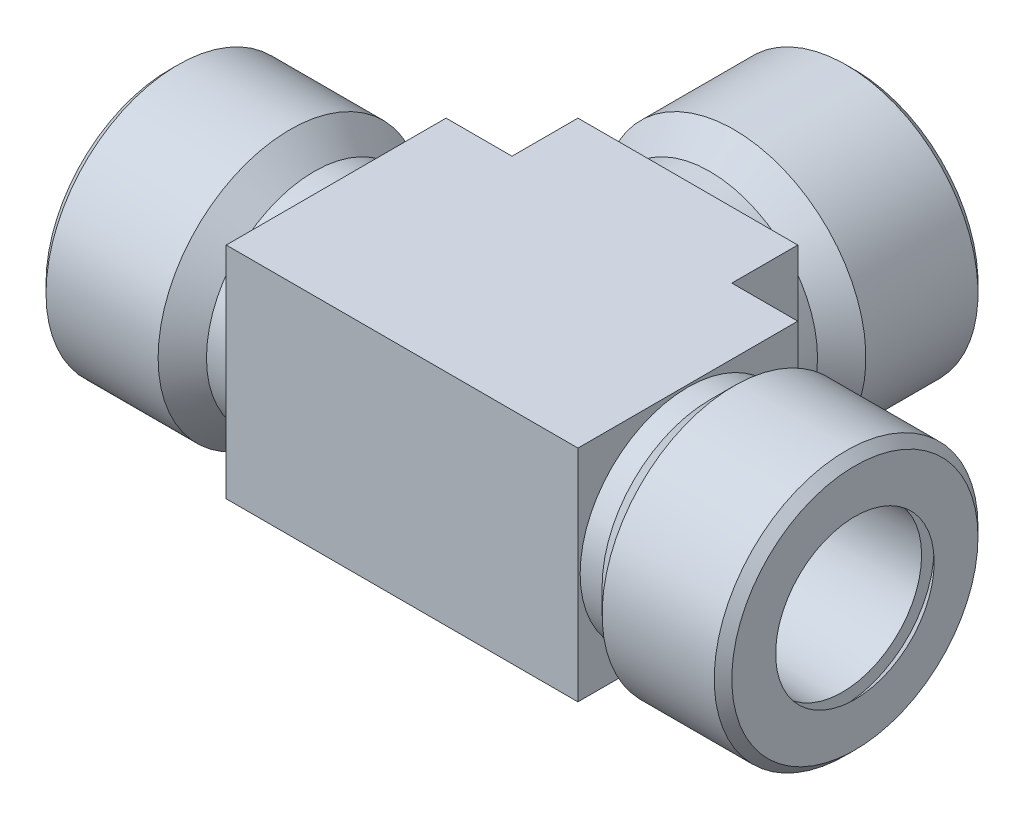
ISO-10303-21;
HEADER;
FILE_DESCRIPTION(('STEP AP214'),'2;1');
FILE_NAME('part.step','',(''),(''),'','','');
FILE_SCHEMA(('AUTOMOTIVE_DESIGN { 1 0 10303 214 1 1 1 1 }'));
ENDSEC;
DATA;
#1=APPLICATION_CONTEXT('core data for automotive mechanical design processes');
#2=APPLICATION_PROTOCOL_DEFINITION('international standard','automotive_design',2000,#1);
#3=PRODUCT_CONTEXT('',#1,'mechanical');
#4=PRODUCT('Part','Part','',(#3));
#5=PRODUCT_RELATED_PRODUCT_CATEGORY('part','',(#4));
#6=PRODUCT_DEFINITION_FORMATION('','',#4);
#7=PRODUCT_DEFINITION_CONTEXT('part definition',#1,'design');
#8=PRODUCT_DEFINITION('design','',#6,#7);
#9=PRODUCT_DEFINITION_SHAPE('','',#8);
#10=(LENGTH_UNIT() NAMED_UNIT(*) SI_UNIT(.MILLI.,.METRE.));
#11=(NAMED_UNIT(*) PLANE_ANGLE_UNIT() SI_UNIT($,.RADIAN.));
#12=(NAMED_UNIT(*) SI_UNIT($,.STERADIAN.) SOLID_ANGLE_UNIT());
#13=UNCERTAINTY_MEASURE_WITH_UNIT(LENGTH_MEASURE(1.E-05),#10,'distance_accuracy_value','');
#14=(GEOMETRIC_REPRESENTATION_CONTEXT(3) GLOBAL_UNCERTAINTY_ASSIGNED_CONTEXT((#13)) GLOBAL_UNIT_ASSIGNED_CONTEXT((#10,
#11,#12)) REPRESENTATION_CONTEXT('',''));
#15=CARTESIAN_POINT('',(0.,0.,0.));
#16=DIRECTION('',(0.,0.,1.));
#17=DIRECTION('',(1.,0.,0.));
#18=AXIS2_PLACEMENT_3D('',#15,#16,#17);
#19=CARTESIAN_POINT('',(65.67678,0.,0.));
#20=DIRECTION('',(-1.,0.,0.));
#21=DIRECTION('',(0.,0.,1.));
#22=AXIS2_PLACEMENT_3D('',#19,#20,#21);
#23=CYLINDRICAL_SURFACE('',#22,9.271);
#24=CARTESIAN_POINT('',(39.624,0.,0.));
#25=DIRECTION('',(0.707106781186548,0.,-0.707106781186547));
#26=DIRECTION('',(-0.707106781186547,0.,-0.707106781186548));
#27=AXIS2_PLACEMENT_3D('',#24,#25,#26);
#28=ELLIPSE('',#27,13.111173936761,9.271);
#29=CARTESIAN_POINT('',(39.624,9.271,0.));
#30=VERTEX_POINT('',#29);
#31=CARTESIAN_POINT('',(39.624,-9.271,0.));
#32=VERTEX_POINT('',#31);
#33=EDGE_CURVE('E102',#30,#32,#28,.F.);
#34=ORIENTED_EDGE('',*,*,#33,.F.);
#35=CARTESIAN_POINT('',(39.624,0.,0.));
#36=DIRECTION('',(-0.707106781186547,0.,-0.707106781186548));
#37=DIRECTION('',(0.707106781186548,0.,-0.707106781186547));
#38=AXIS2_PLACEMENT_3D('',#35,#36,#37);
#39=ELLIPSE('',#38,13.111173936761,9.271);
#40=EDGE_CURVE('E48',#32,#30,#39,.F.);
#41=ORIENTED_EDGE('',*,*,#40,.F.);
#42=EDGE_LOOP('',(#34,#41));
#43=FACE_BOUND('',#42,.T.);
#44=CARTESIAN_POINT('',(65.67678,0.,0.));
#45=DIRECTION('',(-1.,0.,0.));
#46=DIRECTION('',(0.,0.,-1.));
#47=AXIS2_PLACEMENT_3D('',#44,#45,#46);
#48=CIRCLE('',#47,9.271);
#49=CARTESIAN_POINT('',(65.67678,0.,-9.271));
#50=VERTEX_POINT('',#49);
#51=EDGE_CURVE('E111',#50,#50,#48,.T.);
#52=ORIENTED_EDGE('',*,*,#51,.F.);
#53=EDGE_LOOP('',(#52));
#54=FACE_BOUND('',#53,.T.);
#55=CARTESIAN_POINT('',(13.57122,0.,0.));
#56=DIRECTION('',(-1.,0.,0.));
#57=DIRECTION('',(0.,0.,-1.));
#58=AXIS2_PLACEMENT_3D('',#55,#56,#57);
#59=CIRCLE('',#58,9.271);
#60=CARTESIAN_POINT('',(13.57122,0.,-9.271));
#61=VERTEX_POINT('',#60);
#62=EDGE_CURVE('E108',#61,#61,#59,.T.);
#63=ORIENTED_EDGE('',*,*,#62,.T.);
#64=EDGE_LOOP('',(#63));
#65=FACE_BOUND('',#64,.T.);
#66=ADVANCED_FACE('F34',(#43,#54,#65),#23,.F.);
#67=CARTESIAN_POINT('',(65.67678,0.,0.));
#68=DIRECTION('',(1.,0.,0.));
#69=DIRECTION('',(0.,0.,-1.));
#70=AXIS2_PLACEMENT_3D('',#67,#68,#69);
#71=PLANE('',#70);
#72=CARTESIAN_POINT('',(65.67678,0.,0.));
#73=DIRECTION('',(-1.,0.,0.));
#74=DIRECTION('',(0.,0.,-1.));
#75=AXIS2_PLACEMENT_3D('',#72,#73,#74);
#76=CIRCLE('',#75,8.84936340276163);
#77=CARTESIAN_POINT('',(65.67678,0.,-8.84936340276163));
#78=VERTEX_POINT('',#77);
#79=EDGE_CURVE('E411',#78,#78,#76,.T.);
#80=ORIENTED_EDGE('',*,*,#79,.F.);
#81=EDGE_LOOP('',(#80));
#82=FACE_BOUND('',#81,.T.);
#83=ORIENTED_EDGE('',*,*,#51,.T.);
#84=EDGE_LOOP('',(#83));
#85=FACE_BOUND('',#84,.T.);
#86=ADVANCED_FACE('F232',(#82,#85),#71,.F.);
#87=CARTESIAN_POINT('',(13.57122,0.,0.));
#88=DIRECTION('',(1.,0.,0.));
#89=DIRECTION('',(0.,0.,-1.));
#90=AXIS2_PLACEMENT_3D('',#87,#88,#89);
#91=PLANE('',#90);
#92=CARTESIAN_POINT('',(13.57122,0.,0.));
#93=DIRECTION('',(1.,0.,0.));
#94=DIRECTION('',(0.,0.,1.));
#95=AXIS2_PLACEMENT_3D('',#92,#93,#94);
#96=CIRCLE('',#95,8.84936340276163);
#97=CARTESIAN_POINT('',(13.57122,0.,8.84936340276163));
#98=VERTEX_POINT('',#97);
#99=EDGE_CURVE('E353',#98,#98,#96,.T.);
#100=ORIENTED_EDGE('',*,*,#99,.F.);
#101=EDGE_LOOP('',(#100));
#102=FACE_BOUND('',#101,.T.);
#103=ORIENTED_EDGE('',*,*,#62,.F.);
#104=EDGE_LOOP('',(#103));
#105=FACE_BOUND('',#104,.T.);
#106=ADVANCED_FACE('F237',(#102,#105),#91,.T.);
#107=CARTESIAN_POINT('',(39.624,0.,-26.05278));
#108=DIRECTION('',(0.,0.,1.));
#109=DIRECTION('',(1.,0.,0.));
#110=AXIS2_PLACEMENT_3D('',#107,#108,#109);
#111=PLANE('',#110);
#112=CARTESIAN_POINT('',(39.624,0.,-26.05278));
#113=DIRECTION('',(0.,0.,1.));
#114=DIRECTION('',(-1.,0.,0.));
#115=AXIS2_PLACEMENT_3D('',#112,#113,#114);
#116=CIRCLE('',#115,8.84936340276166);
#117=CARTESIAN_POINT('',(30.7746365972383,0.,-26.05278));
#118=VERTEX_POINT('',#117);
#119=EDGE_CURVE('E346',#118,#118,#116,.T.);
#120=ORIENTED_EDGE('',*,*,#119,.F.);
#121=EDGE_LOOP('',(#120));
#122=FACE_BOUND('',#121,.T.);
#123=CARTESIAN_POINT('',(39.624,0.,-26.05278));
#124=DIRECTION('',(0.,0.,-1.));
#125=DIRECTION('',(1.,0.,0.));
#126=AXIS2_PLACEMENT_3D('',#123,#124,#125);
#127=CIRCLE('',#126,9.271);
#128=CARTESIAN_POINT('',(48.895,0.,-26.05278));
#129=VERTEX_POINT('',#128);
#130=EDGE_CURVE('E105',#129,#129,#127,.T.);
#131=ORIENTED_EDGE('',*,*,#130,.F.);
#132=EDGE_LOOP('',(#131));
#133=FACE_BOUND('',#132,.T.);
#134=ADVANCED_FACE('F365',(#122,#133),#111,.T.);
#135=CARTESIAN_POINT('',(39.624,0.,15.241));
#136=DIRECTION('',(0.,0.,-1.));
#137=DIRECTION('',(-1.,0.,0.));
#138=AXIS2_PLACEMENT_3D('',#135,#136,#137);
#139=CYLINDRICAL_SURFACE('',#138,9.271);
#140=ORIENTED_EDGE('',*,*,#130,.T.);
#141=EDGE_LOOP('',(#140));
#142=FACE_BOUND('',#141,.T.);
#143=ORIENTED_EDGE('',*,*,#40,.T.);
#144=ORIENTED_EDGE('',*,*,#33,.T.);
#145=EDGE_LOOP('',(#143,#144));
#146=FACE_BOUND('',#145,.T.);
#147=ADVANCED_FACE('F103',(#142,#146),#139,.F.);
#148=CARTESIAN_POINT('',(39.624,0.,-26.05278));
#149=DIRECTION('',(0.,0.,-1.));
#150=DIRECTION('',(-1.,0.,0.));
#151=AXIS2_PLACEMENT_3D('',#148,#149,#150);
#152=CONICAL_SURFACE('',#151,8.84936340276166,0.0256563400043202);
#153=CARTESIAN_POINT('',(39.624,0.,-38.172644));
#154=DIRECTION('',(0.,0.,-1.));
#155=DIRECTION('',(-1.,0.,0.));
#156=AXIS2_PLACEMENT_3D('',#153,#154,#155);
#157=CIRCLE('',#156,9.16038300000006);
#158=CARTESIAN_POINT('',(30.4636169999999,0.,-38.172644));
#159=VERTEX_POINT('',#158);
#160=EDGE_CURVE('E350',#159,#159,#157,.F.);
#161=ORIENTED_EDGE('',*,*,#160,.F.);
#162=EDGE_LOOP('',(#161));
#163=FACE_BOUND('',#162,.T.);
#164=ORIENTED_EDGE('',*,*,#119,.T.);
#165=EDGE_LOOP('',(#164));
#166=FACE_BOUND('',#165,.T.);
#167=ADVANCED_FACE('F321',(#163,#166),#152,.F.);
#168=CARTESIAN_POINT('',(59.944,-12.7,-20.32));
#169=DIRECTION('',(0.,0.,-1.));
#170=DIRECTION('',(-1.,0.,0.));
#171=AXIS2_PLACEMENT_3D('',#168,#169,#170);
#172=PLANE('',#171);
#173=DIRECTION('',(0.,-1.,0.));
#174=VECTOR('',#173,1.);
#175=CARTESIAN_POINT('',(26.924,12.7,-20.32));
#176=LINE('',#175,#174);
#177=CARTESIAN_POINT('',(26.924,12.7,-20.32));
#178=VERTEX_POINT('',#177);
#179=CARTESIAN_POINT('',(26.924,-12.7,-20.32));
#180=VERTEX_POINT('',#179);
#181=EDGE_CURVE('E150',#178,#180,#176,.T.);
#182=ORIENTED_EDGE('',*,*,#181,.F.);
#183=DIRECTION('',(-1.,0.,0.));
#184=VECTOR('',#183,1.);
#185=CARTESIAN_POINT('',(59.944,12.7,-20.32));
#186=LINE('',#185,#184);
#187=CARTESIAN_POINT('',(52.324,12.7,-20.32));
#188=VERTEX_POINT('',#187);
#189=EDGE_CURVE('E197',#188,#178,#186,.T.);
#190=ORIENTED_EDGE('',*,*,#189,.F.);
#191=DIRECTION('',(0.,-1.,0.));
#192=VECTOR('',#191,1.);
#193=CARTESIAN_POINT('',(52.324,12.7,-20.32));
#194=LINE('',#193,#192);
#195=CARTESIAN_POINT('',(52.324,-12.7,-20.32));
#196=VERTEX_POINT('',#195);
#197=EDGE_CURVE('E175',#188,#196,#194,.T.);
#198=ORIENTED_EDGE('',*,*,#197,.T.);
#199=DIRECTION('',(-1.,0.,0.));
#200=VECTOR('',#199,1.);
#201=CARTESIAN_POINT('',(59.944,-12.7,-20.32));
#202=LINE('',#201,#200);
#203=EDGE_CURVE('E186',#196,#180,#202,.T.);
#204=ORIENTED_EDGE('',*,*,#203,.T.);
#205=EDGE_LOOP('',(#182,#190,#198,#204));
#206=FACE_BOUND('',#205,.T.);
#207=CARTESIAN_POINT('',(39.624,0.,-20.32));
#208=DIRECTION('',(0.,0.,-1.));
#209=DIRECTION('',(-1.,0.,0.));
#210=AXIS2_PLACEMENT_3D('',#207,#208,#209);
#211=CIRCLE('',#210,12.446);
#212=CARTESIAN_POINT('',(27.178,0.,-20.32));
#213=VERTEX_POINT('',#212);
#214=EDGE_CURVE('E120',#213,#213,#211,.T.);
#215=ORIENTED_EDGE('',*,*,#214,.F.);
#216=EDGE_LOOP('',(#215));
#217=FACE_BOUND('',#216,.T.);
#218=ADVANCED_FACE('F318',(#206,#217),#172,.T.);
#219=CARTESIAN_POINT('',(59.944,-12.7,12.7));
#220=DIRECTION('',(1.,0.,0.));
#221=DIRECTION('',(0.,0.,-1.));
#222=AXIS2_PLACEMENT_3D('',#219,#220,#221);
#223=PLANE('',#222);
#224=DIRECTION('',(0.,-1.,0.));
#225=VECTOR('',#224,1.);
#226=CARTESIAN_POINT('',(59.944,12.7,-12.7));
#227=LINE('',#226,#225);
#228=CARTESIAN_POINT('',(59.944,12.7,-12.7));
#229=VERTEX_POINT('',#228);
#230=CARTESIAN_POINT('',(59.944,-12.7,-12.7));
#231=VERTEX_POINT('',#230);
#232=EDGE_CURVE('E172',#229,#231,#227,.T.);
#233=ORIENTED_EDGE('',*,*,#232,.F.);
#234=DIRECTION('',(0.,0.,-1.));
#235=VECTOR('',#234,1.);
#236=CARTESIAN_POINT('',(59.944,12.7,12.7));
#237=LINE('',#236,#235);
#238=CARTESIAN_POINT('',(59.944,12.7,12.7));
#239=VERTEX_POINT('',#238);
#240=EDGE_CURVE('E194',#239,#229,#237,.T.);
#241=ORIENTED_EDGE('',*,*,#240,.F.);
#242=DIRECTION('',(0.,1.,0.));
#243=VECTOR('',#242,1.);
#244=CARTESIAN_POINT('',(59.944,-12.7,12.7));
#245=LINE('',#244,#243);
#246=CARTESIAN_POINT('',(59.944,-12.7,12.7));
#247=VERTEX_POINT('',#246);
#248=EDGE_CURVE('E191',#247,#239,#245,.T.);
#249=ORIENTED_EDGE('',*,*,#248,.F.);
#250=DIRECTION('',(0.,0.,-1.));
#251=VECTOR('',#250,1.);
#252=CARTESIAN_POINT('',(59.944,-12.7,12.7));
#253=LINE('',#252,#251);
#254=EDGE_CURVE('E182',#247,#231,#253,.T.);
#255=ORIENTED_EDGE('',*,*,#254,.T.);
#256=EDGE_LOOP('',(#233,#241,#249,#255));
#257=FACE_BOUND('',#256,.T.);
#258=CARTESIAN_POINT('',(59.944,0.,0.));
#259=DIRECTION('',(1.,0.,0.));
#260=DIRECTION('',(0.,0.,-1.));
#261=AXIS2_PLACEMENT_3D('',#258,#259,#260);
#262=CIRCLE('',#261,12.446);
#263=CARTESIAN_POINT('',(59.944,0.,-12.446));
#264=VERTEX_POINT('',#263);
#265=EDGE_CURVE('E129',#264,#264,#262,.T.);
#266=ORIENTED_EDGE('',*,*,#265,.F.);
#267=EDGE_LOOP('',(#266));
#268=FACE_BOUND('',#267,.T.);
#269=ADVANCED_FACE('F316',(#257,#268),#223,.T.);
#270=CARTESIAN_POINT('',(19.304,-12.7,-20.32));
#271=DIRECTION('',(-1.,0.,0.));
#272=DIRECTION('',(0.,0.,1.));
#273=AXIS2_PLACEMENT_3D('',#270,#271,#272);
#274=PLANE('',#273);
#275=DIRECTION('',(0.,-1.,0.));
#276=VECTOR('',#275,1.);
#277=CARTESIAN_POINT('',(19.304,12.7,-12.7));
#278=LINE('',#277,#276);
#279=CARTESIAN_POINT('',(19.304,12.7,-12.7));
#280=VERTEX_POINT('',#279);
#281=CARTESIAN_POINT('',(19.304,-12.7,-12.7));
#282=VERTEX_POINT('',#281);
#283=EDGE_CURVE('E154',#280,#282,#278,.T.);
#284=ORIENTED_EDGE('',*,*,#283,.T.);
#285=DIRECTION('',(0.,0.,1.));
#286=VECTOR('',#285,1.);
#287=CARTESIAN_POINT('',(19.304,-12.7,-20.32));
#288=LINE('',#287,#286);
#289=CARTESIAN_POINT('',(19.304,-12.7,12.7));
#290=VERTEX_POINT('',#289);
#291=EDGE_CURVE('E189',#282,#290,#288,.T.);
#292=ORIENTED_EDGE('',*,*,#291,.T.);
#293=DIRECTION('',(0.,1.,0.));
#294=VECTOR('',#293,1.);
#295=CARTESIAN_POINT('',(19.304,-12.7,12.7));
#296=LINE('',#295,#294);
#297=CARTESIAN_POINT('',(19.304,12.7,12.7));
#298=VERTEX_POINT('',#297);
#299=EDGE_CURVE('E201',#290,#298,#296,.T.);
#300=ORIENTED_EDGE('',*,*,#299,.T.);
#301=DIRECTION('',(0.,0.,1.));
#302=VECTOR('',#301,1.);
#303=CARTESIAN_POINT('',(19.304,12.7,-20.32));
#304=LINE('',#303,#302);
#305=EDGE_CURVE('E183',#280,#298,#304,.T.);
#306=ORIENTED_EDGE('',*,*,#305,.F.);
#307=EDGE_LOOP('',(#284,#292,#300,#306));
#308=FACE_BOUND('',#307,.T.);
#309=CARTESIAN_POINT('',(19.304,0.,0.));
#310=DIRECTION('',(-1.,0.,0.));
#311=DIRECTION('',(0.,0.,1.));
#312=AXIS2_PLACEMENT_3D('',#309,#310,#311);
#313=CIRCLE('',#312,12.446);
#314=CARTESIAN_POINT('',(19.304,0.,12.446));
#315=VERTEX_POINT('',#314);
#316=EDGE_CURVE('E138',#315,#315,#313,.T.);
#317=ORIENTED_EDGE('',*,*,#316,.F.);
#318=EDGE_LOOP('',(#317));
#319=FACE_BOUND('',#318,.T.);
#320=ADVANCED_FACE('F313',(#308,#319),#274,.T.);
#321=CARTESIAN_POINT('',(19.304,-12.7,12.7));
#322=DIRECTION('',(0.,0.,1.));
#323=DIRECTION('',(1.,0.,0.));
#324=AXIS2_PLACEMENT_3D('',#321,#322,#323);
#325=PLANE('',#324);
#326=DIRECTION('',(1.,0.,0.));
#327=VECTOR('',#326,1.);
#328=CARTESIAN_POINT('',(19.304,12.7,12.7));
#329=LINE('',#328,#327);
#330=EDGE_CURVE('E174',#298,#239,#329,.T.);
#331=ORIENTED_EDGE('',*,*,#330,.F.);
#332=ORIENTED_EDGE('',*,*,#299,.F.);
#333=DIRECTION('',(1.,0.,0.));
#334=VECTOR('',#333,1.);
#335=CARTESIAN_POINT('',(19.304,-12.7,12.7));
#336=LINE('',#335,#334);
#337=EDGE_CURVE('E179',#290,#247,#336,.T.);
#338=ORIENTED_EDGE('',*,*,#337,.T.);
#339=ORIENTED_EDGE('',*,*,#248,.T.);
#340=EDGE_LOOP('',(#331,#332,#338,#339));
#341=FACE_BOUND('',#340,.T.);
#342=ADVANCED_FACE('F308',(#341),#325,.T.);
#343=CARTESIAN_POINT('',(59.944,-12.7,12.7));
#344=DIRECTION('',(0.,1.,0.));
#345=DIRECTION('',(0.,0.,1.));
#346=AXIS2_PLACEMENT_3D('',#343,#344,#345);
#347=PLANE('',#346);
#348=ORIENTED_EDGE('',*,*,#291,.F.);
#349=DIRECTION('',(-1.,0.,0.));
#350=VECTOR('',#349,1.);
#351=CARTESIAN_POINT('',(26.924,-12.7,-12.7));
#352=LINE('',#351,#350);
#353=CARTESIAN_POINT('',(26.924,-12.7,-12.7));
#354=VERTEX_POINT('',#353);
#355=EDGE_CURVE('E148',#354,#282,#352,.T.);
#356=ORIENTED_EDGE('',*,*,#355,.F.);
#357=DIRECTION('',(0.,0.,1.));
#358=VECTOR('',#357,1.);
#359=CARTESIAN_POINT('',(26.924,-12.7,-20.32));
#360=LINE('',#359,#358);
#361=EDGE_CURVE('E142',#180,#354,#360,.T.);
#362=ORIENTED_EDGE('',*,*,#361,.F.);
#363=ORIENTED_EDGE('',*,*,#203,.F.);
#364=DIRECTION('',(0.,0.,-1.));
#365=VECTOR('',#364,1.);
#366=CARTESIAN_POINT('',(52.324,-12.7,-12.7));
#367=LINE('',#366,#365);
#368=CARTESIAN_POINT('',(52.324,-12.7,-12.7));
#369=VERTEX_POINT('',#368);
#370=EDGE_CURVE('E165',#369,#196,#367,.T.);
#371=ORIENTED_EDGE('',*,*,#370,.F.);
#372=DIRECTION('',(-1.,0.,0.));
#373=VECTOR('',#372,1.);
#374=CARTESIAN_POINT('',(59.944,-12.7,-12.7));
#375=LINE('',#374,#373);
#376=EDGE_CURVE('E157',#231,#369,#375,.T.);
#377=ORIENTED_EDGE('',*,*,#376,.F.);
#378=ORIENTED_EDGE('',*,*,#254,.F.);
#379=ORIENTED_EDGE('',*,*,#337,.F.);
#380=EDGE_LOOP('',(#348,#356,#362,#363,#371,#377,#378,#379));
#381=FACE_BOUND('',#380,.T.);
#382=ADVANCED_FACE('F305',(#381),#347,.F.);
#383=CARTESIAN_POINT('',(59.944,12.7,12.7));
#384=DIRECTION('',(0.,1.,0.));
#385=DIRECTION('',(0.,0.,1.));
#386=AXIS2_PLACEMENT_3D('',#383,#384,#385);
#387=PLANE('',#386);
#388=DIRECTION('',(-1.,0.,0.));
#389=VECTOR('',#388,1.);
#390=CARTESIAN_POINT('',(26.924,12.7,-12.7));
#391=LINE('',#390,#389);
#392=CARTESIAN_POINT('',(26.924,12.7,-12.7));
#393=VERTEX_POINT('',#392);
#394=EDGE_CURVE('E56',#393,#280,#391,.T.);
#395=ORIENTED_EDGE('',*,*,#394,.T.);
#396=ORIENTED_EDGE('',*,*,#305,.T.);
#397=ORIENTED_EDGE('',*,*,#330,.T.);
#398=ORIENTED_EDGE('',*,*,#240,.T.);
#399=DIRECTION('',(-1.,0.,0.));
#400=VECTOR('',#399,1.);
#401=CARTESIAN_POINT('',(59.944,12.7,-12.7));
#402=LINE('',#401,#400);
#403=CARTESIAN_POINT('',(52.324,12.7,-12.7));
#404=VERTEX_POINT('',#403);
#405=EDGE_CURVE('E161',#229,#404,#402,.T.);
#406=ORIENTED_EDGE('',*,*,#405,.T.);
#407=DIRECTION('',(0.,0.,-1.));
#408=VECTOR('',#407,1.);
#409=CARTESIAN_POINT('',(52.324,12.7,-12.7));
#410=LINE('',#409,#408);
#411=EDGE_CURVE('E164',#404,#188,#410,.T.);
#412=ORIENTED_EDGE('',*,*,#411,.T.);
#413=ORIENTED_EDGE('',*,*,#189,.T.);
#414=DIRECTION('',(0.,0.,1.));
#415=VECTOR('',#414,1.);
#416=CARTESIAN_POINT('',(26.924,12.7,-20.32));
#417=LINE('',#416,#415);
#418=EDGE_CURVE('E145',#178,#393,#417,.T.);
#419=ORIENTED_EDGE('',*,*,#418,.T.);
#420=EDGE_LOOP('',(#395,#396,#397,#398,#406,#412,#413,#419));
#421=FACE_BOUND('',#420,.T.);
#422=ADVANCED_FACE('F303',(#421),#387,.T.);
#423=CARTESIAN_POINT('',(59.944,12.7,-12.7));
#424=DIRECTION('',(0.,0.,1.));
#425=DIRECTION('',(1.,0.,0.));
#426=AXIS2_PLACEMENT_3D('',#423,#424,#425);
#427=PLANE('',#426);
#428=ORIENTED_EDGE('',*,*,#376,.T.);
#429=DIRECTION('',(0.,-1.,0.));
#430=VECTOR('',#429,1.);
#431=CARTESIAN_POINT('',(52.324,12.7,-12.7));
#432=LINE('',#431,#430);
#433=EDGE_CURVE('E168',#404,#369,#432,.T.);
#434=ORIENTED_EDGE('',*,*,#433,.F.);
#435=ORIENTED_EDGE('',*,*,#405,.F.);
#436=ORIENTED_EDGE('',*,*,#232,.T.);
#437=EDGE_LOOP('',(#428,#434,#435,#436));
#438=FACE_BOUND('',#437,.T.);
#439=ADVANCED_FACE('F299',(#438),#427,.F.);
#440=CARTESIAN_POINT('',(52.324,12.7,-12.7));
#441=DIRECTION('',(-1.,0.,0.));
#442=DIRECTION('',(0.,0.,1.));
#443=AXIS2_PLACEMENT_3D('',#440,#441,#442);
#444=PLANE('',#443);
#445=ORIENTED_EDGE('',*,*,#370,.T.);
#446=ORIENTED_EDGE('',*,*,#197,.F.);
#447=ORIENTED_EDGE('',*,*,#411,.F.);
#448=ORIENTED_EDGE('',*,*,#433,.T.);
#449=EDGE_LOOP('',(#445,#446,#447,#448));
#450=FACE_BOUND('',#449,.T.);
#451=ADVANCED_FACE('F293',(#450),#444,.F.);
#452=CARTESIAN_POINT('',(26.924,12.7,-12.7));
#453=DIRECTION('',(0.,0.,1.));
#454=DIRECTION('',(1.,0.,0.));
#455=AXIS2_PLACEMENT_3D('',#452,#453,#454);
#456=PLANE('',#455);
#457=ORIENTED_EDGE('',*,*,#355,.T.);
#458=ORIENTED_EDGE('',*,*,#283,.F.);
#459=ORIENTED_EDGE('',*,*,#394,.F.);
#460=DIRECTION('',(0.,-1.,0.));
#461=VECTOR('',#460,1.);
#462=CARTESIAN_POINT('',(26.924,12.7,-12.7));
#463=LINE('',#462,#461);
#464=EDGE_CURVE('E158',#393,#354,#463,.T.);
#465=ORIENTED_EDGE('',*,*,#464,.T.);
#466=EDGE_LOOP('',(#457,#458,#459,#465));
#467=FACE_BOUND('',#466,.T.);
#468=ADVANCED_FACE('F290',(#467),#456,.F.);
#469=CARTESIAN_POINT('',(26.924,12.7,-20.32));
#470=DIRECTION('',(1.,0.,0.));
#471=DIRECTION('',(0.,0.,-1.));
#472=AXIS2_PLACEMENT_3D('',#469,#470,#471);
#473=PLANE('',#472);
#474=ORIENTED_EDGE('',*,*,#361,.T.);
#475=ORIENTED_EDGE('',*,*,#464,.F.);
#476=ORIENTED_EDGE('',*,*,#418,.F.);
#477=ORIENTED_EDGE('',*,*,#181,.T.);
#478=EDGE_LOOP('',(#474,#475,#476,#477));
#479=FACE_BOUND('',#478,.T.);
#480=ADVANCED_FACE('F288',(#479),#473,.F.);
#481=CARTESIAN_POINT('',(16.764,0.,0.));
#482=DIRECTION('',(1.,0.,0.));
#483=DIRECTION('',(0.,0.,-1.));
#484=AXIS2_PLACEMENT_3D('',#481,#482,#483);
#485=CYLINDRICAL_SURFACE('',#484,12.446);
#486=CARTESIAN_POINT('',(16.764,0.,0.));
#487=DIRECTION('',(-1.,0.,0.));
#488=DIRECTION('',(0.,0.,1.));
#489=AXIS2_PLACEMENT_3D('',#486,#487,#488);
#490=CIRCLE('',#489,12.446);
#491=CARTESIAN_POINT('',(16.764,0.,12.446));
#492=VERTEX_POINT('',#491);
#493=EDGE_CURVE('E139',#492,#492,#490,.T.);
#494=ORIENTED_EDGE('',*,*,#493,.F.);
#495=EDGE_LOOP('',(#494));
#496=FACE_BOUND('',#495,.T.);
#497=ORIENTED_EDGE('',*,*,#316,.T.);
#498=EDGE_LOOP('',(#497));
#499=FACE_BOUND('',#498,.T.);
#500=ADVANCED_FACE('F284',(#496,#499),#485,.T.);
#501=CARTESIAN_POINT('',(16.764,0.,0.));
#502=DIRECTION('',(-1.,0.,0.));
#503=DIRECTION('',(0.,0.,1.));
#504=AXIS2_PLACEMENT_3D('',#501,#502,#503);
#505=CONICAL_SURFACE('',#504,12.446,0.785398163397451);
#506=CARTESIAN_POINT('',(13.97,0.,0.));
#507=DIRECTION('',(-1.,0.,0.));
#508=DIRECTION('',(0.,0.,1.));
#509=AXIS2_PLACEMENT_3D('',#506,#507,#508);
#510=CIRCLE('',#509,15.24);
#511=CARTESIAN_POINT('',(13.97,0.,15.24));
#512=VERTEX_POINT('',#511);
#513=EDGE_CURVE('E133',#512,#512,#510,.T.);
#514=ORIENTED_EDGE('',*,*,#513,.F.);
#515=EDGE_LOOP('',(#514));
#516=FACE_BOUND('',#515,.T.);
#517=ORIENTED_EDGE('',*,*,#493,.T.);
#518=EDGE_LOOP('',(#517));
#519=FACE_BOUND('',#518,.T.);
#520=ADVANCED_FACE('F280',(#516,#519),#505,.T.);
#521=CARTESIAN_POINT('',(0.,0.,0.));
#522=DIRECTION('',(1.,0.,0.));
#523=DIRECTION('',(0.,0.,-1.));
#524=AXIS2_PLACEMENT_3D('',#521,#522,#523);
#525=CYLINDRICAL_SURFACE('',#524,15.24);
#526=CARTESIAN_POINT('',(1.016,0.,0.));
#527=DIRECTION('',(-1.,0.,0.));
#528=DIRECTION('',(0.,0.,1.));
#529=AXIS2_PLACEMENT_3D('',#526,#527,#528);
#530=CIRCLE('',#529,15.24);
#531=CARTESIAN_POINT('',(1.016,0.,15.24));
#532=VERTEX_POINT('',#531);
#533=EDGE_CURVE('E208',#532,#532,#530,.F.);
#534=ORIENTED_EDGE('',*,*,#533,.T.);
#535=EDGE_LOOP('',(#534));
#536=FACE_BOUND('',#535,.T.);
#537=ORIENTED_EDGE('',*,*,#513,.T.);
#538=EDGE_LOOP('',(#537));
#539=FACE_BOUND('',#538,.T.);
#540=ADVANCED_FACE('F276',(#536,#539),#525,.T.);
#541=CARTESIAN_POINT('',(0.,0.,0.));
#542=DIRECTION('',(-1.,0.,0.));
#543=DIRECTION('',(0.,0.,1.));
#544=AXIS2_PLACEMENT_3D('',#541,#542,#543);
#545=PLANE('',#544);
#546=CARTESIAN_POINT('',(0.,0.,0.));
#547=DIRECTION('',(-1.,0.,0.));
#548=DIRECTION('',(0.,0.,1.));
#549=AXIS2_PLACEMENT_3D('',#546,#547,#548);
#550=CIRCLE('',#549,14.224);
#551=CARTESIAN_POINT('',(0.,0.,14.224));
#552=VERTEX_POINT('',#551);
#553=EDGE_CURVE('E204',#552,#552,#550,.T.);
#554=ORIENTED_EDGE('',*,*,#553,.T.);
#555=EDGE_LOOP('',(#554));
#556=FACE_BOUND('',#555,.T.);
#557=CARTESIAN_POINT('',(0.,0.,0.));
#558=DIRECTION('',(-1.,0.,0.));
#559=DIRECTION('',(0.,0.,-1.));
#560=AXIS2_PLACEMENT_3D('',#557,#558,#559);
#561=CIRCLE('',#560,10.611739);
#562=CARTESIAN_POINT('',(0.,0.,-10.611739));
#563=VERTEX_POINT('',#562);
#564=EDGE_CURVE('E344',#563,#563,#561,.T.);
#565=ORIENTED_EDGE('',*,*,#564,.F.);
#566=EDGE_LOOP('',(#565));
#567=FACE_BOUND('',#566,.T.);
#568=ADVANCED_FACE('F272',(#556,#567),#545,.T.);
#569=CARTESIAN_POINT('',(62.484,0.,0.));
#570=DIRECTION('',(-1.,0.,0.));
#571=DIRECTION('',(0.,0.,1.));
#572=AXIS2_PLACEMENT_3D('',#569,#570,#571);
#573=CYLINDRICAL_SURFACE('',#572,12.446);
#574=CARTESIAN_POINT('',(62.484,0.,0.));
#575=DIRECTION('',(1.,0.,0.));
#576=DIRECTION('',(0.,0.,-1.));
#577=AXIS2_PLACEMENT_3D('',#574,#575,#576);
#578=CIRCLE('',#577,12.446);
#579=CARTESIAN_POINT('',(62.484,0.,-12.446));
#580=VERTEX_POINT('',#579);
#581=EDGE_CURVE('E130',#580,#580,#578,.T.);
#582=ORIENTED_EDGE('',*,*,#581,.F.);
#583=EDGE_LOOP('',(#582));
#584=FACE_BOUND('',#583,.T.);
#585=ORIENTED_EDGE('',*,*,#265,.T.);
#586=EDGE_LOOP('',(#585));
#587=FACE_BOUND('',#586,.T.);
#588=ADVANCED_FACE('F268',(#584,#587),#573,.T.);
#589=CARTESIAN_POINT('',(62.484,0.,0.));
#590=DIRECTION('',(1.,0.,0.));
#591=DIRECTION('',(0.,0.,-1.));
#592=AXIS2_PLACEMENT_3D('',#589,#590,#591);
#593=CONICAL_SURFACE('',#592,12.446,0.78539816339745);
#594=CARTESIAN_POINT('',(65.278,0.,0.));
#595=DIRECTION('',(1.,0.,0.));
#596=DIRECTION('',(0.,0.,-1.));
#597=AXIS2_PLACEMENT_3D('',#594,#595,#596);
#598=CIRCLE('',#597,15.24);
#599=CARTESIAN_POINT('',(65.278,0.,-15.24));
#600=VERTEX_POINT('',#599);
#601=EDGE_CURVE('E124',#600,#600,#598,.T.);
#602=ORIENTED_EDGE('',*,*,#601,.F.);
#603=EDGE_LOOP('',(#602));
#604=FACE_BOUND('',#603,.T.);
#605=ORIENTED_EDGE('',*,*,#581,.T.);
#606=EDGE_LOOP('',(#605));
#607=FACE_BOUND('',#606,.T.);
#608=ADVANCED_FACE('F264',(#604,#607),#593,.T.);
#609=CARTESIAN_POINT('',(79.248,0.,0.));
#610=DIRECTION('',(-1.,0.,0.));
#611=DIRECTION('',(0.,0.,1.));
#612=AXIS2_PLACEMENT_3D('',#609,#610,#611);
#613=CYLINDRICAL_SURFACE('',#612,15.24);
#614=CARTESIAN_POINT('',(78.232,0.,0.));
#615=DIRECTION('',(1.,0.,0.));
#616=DIRECTION('',(0.,0.,-1.));
#617=AXIS2_PLACEMENT_3D('',#614,#615,#616);
#618=CIRCLE('',#617,15.24);
#619=CARTESIAN_POINT('',(78.232,0.,-15.24));
#620=VERTEX_POINT('',#619);
#621=EDGE_CURVE('E214',#620,#620,#618,.F.);
#622=ORIENTED_EDGE('',*,*,#621,.T.);
#623=EDGE_LOOP('',(#622));
#624=FACE_BOUND('',#623,.T.);
#625=ORIENTED_EDGE('',*,*,#601,.T.);
#626=EDGE_LOOP('',(#625));
#627=FACE_BOUND('',#626,.T.);
#628=ADVANCED_FACE('F260',(#624,#627),#613,.T.);
#629=CARTESIAN_POINT('',(79.248,0.,0.));
#630=DIRECTION('',(1.,0.,0.));
#631=DIRECTION('',(0.,0.,-1.));
#632=AXIS2_PLACEMENT_3D('',#629,#630,#631);
#633=PLANE('',#632);
#634=CARTESIAN_POINT('',(79.248,0.,0.));
#635=DIRECTION('',(1.,0.,0.));
#636=DIRECTION('',(0.,0.,-1.));
#637=AXIS2_PLACEMENT_3D('',#634,#635,#636);
#638=CIRCLE('',#637,14.224);
#639=CARTESIAN_POINT('',(79.248,0.,-14.224));
#640=VERTEX_POINT('',#639);
#641=EDGE_CURVE('E211',#640,#640,#638,.T.);
#642=ORIENTED_EDGE('',*,*,#641,.T.);
#643=EDGE_LOOP('',(#642));
#644=FACE_BOUND('',#643,.T.);
#645=CARTESIAN_POINT('',(79.248,0.,0.));
#646=DIRECTION('',(1.,0.,0.));
#647=DIRECTION('',(0.,0.,-1.));
#648=AXIS2_PLACEMENT_3D('',#645,#646,#647);
#649=CIRCLE('',#648,9.16038300000002);
#650=CARTESIAN_POINT('',(79.248,0.,-9.16038300000002));
#651=VERTEX_POINT('',#650);
#652=EDGE_CURVE('E405',#651,#651,#649,.T.);
#653=ORIENTED_EDGE('',*,*,#652,.F.);
#654=EDGE_LOOP('',(#653));
#655=FACE_BOUND('',#654,.T.);
#656=ADVANCED_FACE('F256',(#644,#655),#633,.T.);
#657=CARTESIAN_POINT('',(39.624,0.,-22.86));
#658=DIRECTION('',(0.,0.,1.));
#659=DIRECTION('',(1.,0.,0.));
#660=AXIS2_PLACEMENT_3D('',#657,#658,#659);
#661=CYLINDRICAL_SURFACE('',#660,12.446);
#662=CARTESIAN_POINT('',(39.624,0.,-22.86));
#663=DIRECTION('',(0.,0.,-1.));
#664=DIRECTION('',(-1.,0.,0.));
#665=AXIS2_PLACEMENT_3D('',#662,#663,#664);
#666=CIRCLE('',#665,12.446);
#667=CARTESIAN_POINT('',(27.178,0.,-22.86));
#668=VERTEX_POINT('',#667);
#669=EDGE_CURVE('E121',#668,#668,#666,.T.);
#670=ORIENTED_EDGE('',*,*,#669,.F.);
#671=EDGE_LOOP('',(#670));
#672=FACE_BOUND('',#671,.T.);
#673=ORIENTED_EDGE('',*,*,#214,.T.);
#674=EDGE_LOOP('',(#673));
#675=FACE_BOUND('',#674,.T.);
#676=ADVANCED_FACE('F252',(#672,#675),#661,.T.);
#677=CARTESIAN_POINT('',(39.624,0.,-22.86));
#678=DIRECTION('',(0.,0.,-1.));
#679=DIRECTION('',(-1.,0.,0.));
#680=AXIS2_PLACEMENT_3D('',#677,#678,#679);
#681=CONICAL_SURFACE('',#680,12.446,0.785398163397452);
#682=CARTESIAN_POINT('',(39.624,0.,-25.654));
#683=DIRECTION('',(0.,0.,-1.));
#684=DIRECTION('',(-1.,0.,0.));
#685=AXIS2_PLACEMENT_3D('',#682,#683,#684);
#686=CIRCLE('',#685,15.24);
#687=CARTESIAN_POINT('',(24.384,0.,-25.654));
#688=VERTEX_POINT('',#687);
#689=EDGE_CURVE('E116',#688,#688,#686,.T.);
#690=ORIENTED_EDGE('',*,*,#689,.F.);
#691=EDGE_LOOP('',(#690));
#692=FACE_BOUND('',#691,.T.);
#693=ORIENTED_EDGE('',*,*,#669,.T.);
#694=EDGE_LOOP('',(#693));
#695=FACE_BOUND('',#694,.T.);
#696=ADVANCED_FACE('F248',(#692,#695),#681,.T.);
#697=CARTESIAN_POINT('',(39.624,0.,-39.624));
#698=DIRECTION('',(0.,0.,1.));
#699=DIRECTION('',(1.,0.,0.));
#700=AXIS2_PLACEMENT_3D('',#697,#698,#699);
#701=CYLINDRICAL_SURFACE('',#700,15.24);
#702=CARTESIAN_POINT('',(39.624,0.,-38.608));
#703=DIRECTION('',(0.,0.,-1.));
#704=DIRECTION('',(-1.,0.,0.));
#705=AXIS2_PLACEMENT_3D('',#702,#703,#704);
#706=CIRCLE('',#705,15.24);
#707=CARTESIAN_POINT('',(24.384,0.,-38.608));
#708=VERTEX_POINT('',#707);
#709=EDGE_CURVE('E11',#708,#708,#706,.F.);
#710=ORIENTED_EDGE('',*,*,#709,.T.);
#711=EDGE_LOOP('',(#710));
#712=FACE_BOUND('',#711,.T.);
#713=ORIENTED_EDGE('',*,*,#689,.T.);
#714=EDGE_LOOP('',(#713));
#715=FACE_BOUND('',#714,.T.);
#716=ADVANCED_FACE('F245',(#712,#715),#701,.T.);
#717=CARTESIAN_POINT('',(39.624,0.,-39.624));
#718=DIRECTION('',(0.,0.,-1.));
#719=DIRECTION('',(-1.,0.,0.));
#720=AXIS2_PLACEMENT_3D('',#717,#718,#719);
#721=PLANE('',#720);
#722=CARTESIAN_POINT('',(39.624,0.,-39.624));
#723=DIRECTION('',(0.,0.,-1.));
#724=DIRECTION('',(-1.,0.,0.));
#725=AXIS2_PLACEMENT_3D('',#722,#723,#724);
#726=CIRCLE('',#725,14.224);
#727=CARTESIAN_POINT('',(25.4,0.,-39.624));
#728=VERTEX_POINT('',#727);
#729=EDGE_CURVE('E42',#728,#728,#726,.T.);
#730=ORIENTED_EDGE('',*,*,#729,.T.);
#731=EDGE_LOOP('',(#730));
#732=FACE_BOUND('',#731,.T.);
#733=CARTESIAN_POINT('',(39.624,0.,-39.624));
#734=DIRECTION('',(0.,0.,-1.));
#735=DIRECTION('',(1.,0.,0.));
#736=AXIS2_PLACEMENT_3D('',#733,#734,#735);
#737=CIRCLE('',#736,10.611739);
#738=CARTESIAN_POINT('',(50.235739,0.,-39.624));
#739=VERTEX_POINT('',#738);
#740=EDGE_CURVE('E359',#739,#739,#737,.T.);
#741=ORIENTED_EDGE('',*,*,#740,.F.);
#742=EDGE_LOOP('',(#741));
#743=FACE_BOUND('',#742,.T.);
#744=ADVANCED_FACE('F219',(#732,#743),#721,.T.);
#745=CARTESIAN_POINT('',(39.624,0.,-39.624));
#746=DIRECTION('',(0.,0.,-1.));
#747=DIRECTION('',(1.,0.,0.));
#748=AXIS2_PLACEMENT_3D('',#745,#746,#747);
#749=CONICAL_SURFACE('',#748,10.611739,0.785398163397443);
#750=ORIENTED_EDGE('',*,*,#160,.T.);
#751=EDGE_LOOP('',(#750));
#752=FACE_BOUND('',#751,.T.);
#753=ORIENTED_EDGE('',*,*,#740,.T.);
#754=EDGE_LOOP('',(#753));
#755=FACE_BOUND('',#754,.T.);
#756=ADVANCED_FACE('F244',(#752,#755),#749,.F.);
#757=CARTESIAN_POINT('',(0.,0.,0.));
#758=DIRECTION('',(-1.,0.,0.));
#759=DIRECTION('',(0.,0.,-1.));
#760=AXIS2_PLACEMENT_3D('',#757,#758,#759);
#761=CONICAL_SURFACE('',#760,10.611739,0.785398163397444);
#762=CARTESIAN_POINT('',(1.45135600000002,0.,0.));
#763=DIRECTION('',(-1.,0.,0.));
#764=DIRECTION('',(0.,0.,1.));
#765=AXIS2_PLACEMENT_3D('',#762,#763,#764);
#766=CIRCLE('',#765,9.16038300000005);
#767=CARTESIAN_POINT('',(1.45135600000002,0.,9.16038300000005));
#768=VERTEX_POINT('',#767);
#769=EDGE_CURVE('E347',#768,#768,#766,.F.);
#770=ORIENTED_EDGE('',*,*,#769,.T.);
#771=EDGE_LOOP('',(#770));
#772=FACE_BOUND('',#771,.T.);
#773=ORIENTED_EDGE('',*,*,#564,.T.);
#774=EDGE_LOOP('',(#773));
#775=FACE_BOUND('',#774,.T.);
#776=ADVANCED_FACE('F379',(#772,#775),#761,.F.);
#777=CARTESIAN_POINT('',(13.57122,0.,0.));
#778=DIRECTION('',(-1.,0.,0.));
#779=DIRECTION('',(0.,0.,1.));
#780=AXIS2_PLACEMENT_3D('',#777,#778,#779);
#781=CONICAL_SURFACE('',#780,8.84936340276163,0.025656340004321);
#782=ORIENTED_EDGE('',*,*,#769,.F.);
#783=EDGE_LOOP('',(#782));
#784=FACE_BOUND('',#783,.T.);
#785=ORIENTED_EDGE('',*,*,#99,.T.);
#786=EDGE_LOOP('',(#785));
#787=FACE_BOUND('',#786,.T.);
#788=ADVANCED_FACE('F386',(#784,#787),#781,.F.);
#789=CARTESIAN_POINT('',(77.796644,0.,0.));
#790=DIRECTION('',(-1.,0.,0.));
#791=DIRECTION('',(0.,0.,1.));
#792=AXIS2_PLACEMENT_3D('',#789,#790,#791);
#793=PLANE('',#792);
#794=CARTESIAN_POINT('',(77.796644,0.,0.));
#795=DIRECTION('',(1.,0.,0.));
#796=DIRECTION('',(0.,0.,-1.));
#797=AXIS2_PLACEMENT_3D('',#794,#795,#796);
#798=CIRCLE('',#797,9.16038300000005);
#799=CARTESIAN_POINT('',(77.796644,0.,-9.16038300000005));
#800=VERTEX_POINT('',#799);
#801=EDGE_CURVE('E407',#800,#800,#798,.F.);
#802=ORIENTED_EDGE('',*,*,#801,.T.);
#803=EDGE_LOOP('',(#802));
#804=FACE_BOUND('',#803,.T.);
#805=CARTESIAN_POINT('',(77.796644,0.,0.));
#806=DIRECTION('',(1.,0.,0.));
#807=DIRECTION('',(0.,0.,-1.));
#808=AXIS2_PLACEMENT_3D('',#805,#806,#807);
#809=CIRCLE('',#808,10.611739);
#810=CARTESIAN_POINT('',(77.796644,0.,-10.611739));
#811=VERTEX_POINT('',#810);
#812=EDGE_CURVE('E402',#811,#811,#809,.T.);
#813=ORIENTED_EDGE('',*,*,#812,.T.);
#814=EDGE_LOOP('',(#813));
#815=FACE_BOUND('',#814,.T.);
#816=ADVANCED_FACE('F390',(#804,#815),#793,.F.);
#817=CARTESIAN_POINT('',(79.248,0.,0.));
#818=DIRECTION('',(-1.,0.,0.));
#819=DIRECTION('',(0.,0.,1.));
#820=AXIS2_PLACEMENT_3D('',#817,#818,#819);
#821=CONICAL_SURFACE('',#820,9.16038300000002,0.785398163397435);
#822=ORIENTED_EDGE('',*,*,#812,.F.);
#823=EDGE_LOOP('',(#822));
#824=FACE_BOUND('',#823,.T.);
#825=ORIENTED_EDGE('',*,*,#652,.T.);
#826=EDGE_LOOP('',(#825));
#827=FACE_BOUND('',#826,.T.);
#828=ADVANCED_FACE('F335',(#824,#827),#821,.F.);
#829=CARTESIAN_POINT('',(65.67678,0.,0.));
#830=DIRECTION('',(1.,0.,0.));
#831=DIRECTION('',(0.,0.,-1.));
#832=AXIS2_PLACEMENT_3D('',#829,#830,#831);
#833=CONICAL_SURFACE('',#832,8.84936340276163,0.025656340004321);
#834=ORIENTED_EDGE('',*,*,#801,.F.);
#835=EDGE_LOOP('',(#834));
#836=FACE_BOUND('',#835,.T.);
#837=ORIENTED_EDGE('',*,*,#79,.T.);
#838=EDGE_LOOP('',(#837));
#839=FACE_BOUND('',#838,.T.);
#840=ADVANCED_FACE('F330',(#836,#839),#833,.F.);
#841=CARTESIAN_POINT('',(0.,0.,0.));
#842=DIRECTION('',(1.,0.,0.));
#843=DIRECTION('',(0.,0.,-1.));
#844=AXIS2_PLACEMENT_3D('',#841,#842,#843);
#845=CONICAL_SURFACE('',#844,14.224,0.785398163397452);
#846=ORIENTED_EDGE('',*,*,#533,.F.);
#847=EDGE_LOOP('',(#846));
#848=FACE_BOUND('',#847,.T.);
#849=ORIENTED_EDGE('',*,*,#553,.F.);
#850=EDGE_LOOP('',(#849));
#851=FACE_BOUND('',#850,.T.);
#852=ADVANCED_FACE('F228',(#848,#851),#845,.T.);
#853=CARTESIAN_POINT('',(79.248,0.,0.));
#854=DIRECTION('',(-1.,0.,0.));
#855=DIRECTION('',(0.,0.,1.));
#856=AXIS2_PLACEMENT_3D('',#853,#854,#855);
#857=CONICAL_SURFACE('',#856,14.224,0.785398163397447);
#858=ORIENTED_EDGE('',*,*,#621,.F.);
#859=EDGE_LOOP('',(#858));
#860=FACE_BOUND('',#859,.T.);
#861=ORIENTED_EDGE('',*,*,#641,.F.);
#862=EDGE_LOOP('',(#861));
#863=FACE_BOUND('',#862,.T.);
#864=ADVANCED_FACE('F223',(#860,#863),#857,.T.);
#865=CARTESIAN_POINT('',(39.624,0.,-39.624));
#866=DIRECTION('',(0.,0.,1.));
#867=DIRECTION('',(1.,0.,0.));
#868=AXIS2_PLACEMENT_3D('',#865,#866,#867);
#869=CONICAL_SURFACE('',#868,14.224,0.785398163397457);
#870=ORIENTED_EDGE('',*,*,#709,.F.);
#871=EDGE_LOOP('',(#870));
#872=FACE_BOUND('',#871,.T.);
#873=ORIENTED_EDGE('',*,*,#729,.F.);
#874=EDGE_LOOP('',(#873));
#875=FACE_BOUND('',#874,.T.);
#876=ADVANCED_FACE('F36',(#872,#875),#869,.T.);
#877=CLOSED_SHELL('',(#66,#86,#106,#134,#147,#167,#218,#269,#320,#342,#382,#422,#439,#451,#468,
#480,#500,#520,#540,#568,#588,#608,#628,#656,#676,#696,#716,#744,#756,#776,#788,#816,#828,#840,
#852,#864,#876));
#878=MANIFOLD_SOLID_BREP('B2',#877);
#879=ADVANCED_BREP_SHAPE_REPRESENTATION('',(#18,#878),#14);
#880=SHAPE_DEFINITION_REPRESENTATION(#9,#879);
ENDSEC;
END-ISO-10303-21;
